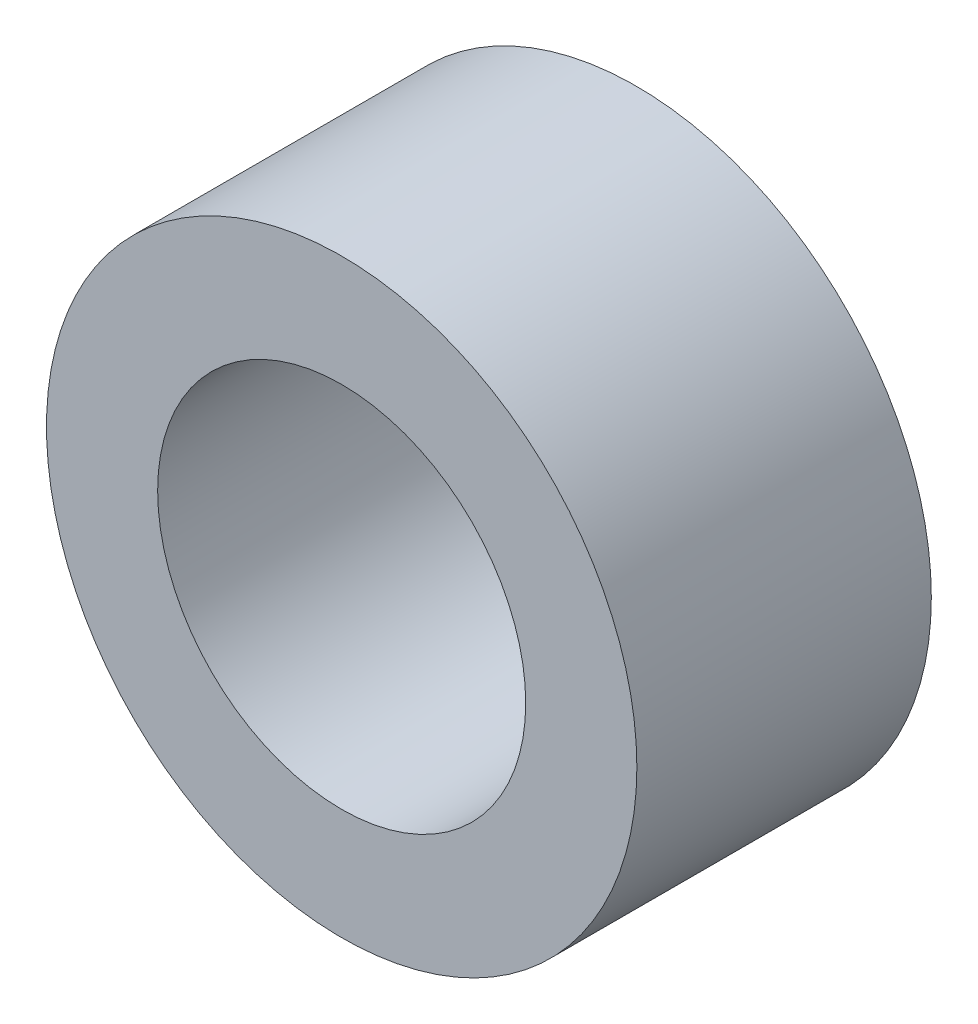
ISO-10303-21;
HEADER;
FILE_DESCRIPTION(('STEP AP214'),'2;1');
FILE_NAME('part.step','',(''),(''),'','','');
FILE_SCHEMA(('AUTOMOTIVE_DESIGN { 1 0 10303 214 1 1 1 1 }'));
ENDSEC;
DATA;
#1=APPLICATION_CONTEXT('core data for automotive mechanical design processes');
#2=APPLICATION_PROTOCOL_DEFINITION('international standard','automotive_design',2000,#1);
#3=PRODUCT_CONTEXT('',#1,'mechanical');
#4=PRODUCT('Part','Part','',(#3));
#5=PRODUCT_RELATED_PRODUCT_CATEGORY('part','',(#4));
#6=PRODUCT_DEFINITION_FORMATION('','',#4);
#7=PRODUCT_DEFINITION_CONTEXT('part definition',#1,'design');
#8=PRODUCT_DEFINITION('design','',#6,#7);
#9=PRODUCT_DEFINITION_SHAPE('','',#8);
#10=(LENGTH_UNIT() NAMED_UNIT(*) SI_UNIT(.MILLI.,.METRE.));
#11=(NAMED_UNIT(*) PLANE_ANGLE_UNIT() SI_UNIT($,.RADIAN.));
#12=(NAMED_UNIT(*) SI_UNIT($,.STERADIAN.) SOLID_ANGLE_UNIT());
#13=UNCERTAINTY_MEASURE_WITH_UNIT(LENGTH_MEASURE(1.E-05),#10,'distance_accuracy_value','');
#14=(GEOMETRIC_REPRESENTATION_CONTEXT(3) GLOBAL_UNCERTAINTY_ASSIGNED_CONTEXT((#13)) GLOBAL_UNIT_ASSIGNED_CONTEXT((#10,
#11,#12)) REPRESENTATION_CONTEXT('',''));
#15=CARTESIAN_POINT('',(0.,0.,0.));
#16=DIRECTION('',(0.,0.,1.));
#17=DIRECTION('',(1.,0.,0.));
#18=AXIS2_PLACEMENT_3D('',#15,#16,#17);
#19=CARTESIAN_POINT('',(0.,0.,2.));
#20=DIRECTION('',(0.,0.,1.));
#21=DIRECTION('',(1.,0.,0.));
#22=AXIS2_PLACEMENT_3D('',#19,#20,#21);
#23=PLANE('',#22);
#24=CARTESIAN_POINT('',(0.,0.,2.));
#25=DIRECTION('',(0.,0.,1.));
#26=DIRECTION('',(1.,0.,0.));
#27=AXIS2_PLACEMENT_3D('',#24,#25,#26);
#28=CIRCLE('',#27,4.01);
#29=CARTESIAN_POINT('',(4.01,0.,2.));
#30=VERTEX_POINT('',#29);
#31=EDGE_CURVE('E10',#30,#30,#28,.T.);
#32=ORIENTED_EDGE('',*,*,#31,.T.);
#33=EDGE_LOOP('',(#32));
#34=FACE_BOUND('',#33,.T.);
#35=CARTESIAN_POINT('',(0.,0.,2.));
#36=DIRECTION('',(0.,0.,1.));
#37=DIRECTION('',(1.,0.,0.));
#38=AXIS2_PLACEMENT_3D('',#35,#36,#37);
#39=CIRCLE('',#38,2.5);
#40=CARTESIAN_POINT('',(2.5,0.,2.));
#41=VERTEX_POINT('',#40);
#42=EDGE_CURVE('E44',#41,#41,#39,.T.);
#43=ORIENTED_EDGE('',*,*,#42,.F.);
#44=EDGE_LOOP('',(#43));
#45=FACE_BOUND('',#44,.T.);
#46=ADVANCED_FACE('F33',(#34,#45),#23,.T.);
#47=CARTESIAN_POINT('',(0.,0.,-2.));
#48=DIRECTION('',(0.,0.,1.));
#49=DIRECTION('',(1.,0.,0.));
#50=AXIS2_PLACEMENT_3D('',#47,#48,#49);
#51=PLANE('',#50);
#52=CARTESIAN_POINT('',(0.,0.,-2.));
#53=DIRECTION('',(0.,0.,1.));
#54=DIRECTION('',(1.,0.,0.));
#55=AXIS2_PLACEMENT_3D('',#52,#53,#54);
#56=CIRCLE('',#55,4.01);
#57=CARTESIAN_POINT('',(4.01,0.,-2.));
#58=VERTEX_POINT('',#57);
#59=EDGE_CURVE('E37',#58,#58,#56,.T.);
#60=ORIENTED_EDGE('',*,*,#59,.F.);
#61=EDGE_LOOP('',(#60));
#62=FACE_BOUND('',#61,.T.);
#63=CARTESIAN_POINT('',(0.,0.,-2.));
#64=DIRECTION('',(0.,0.,1.));
#65=DIRECTION('',(1.,0.,0.));
#66=AXIS2_PLACEMENT_3D('',#63,#64,#65);
#67=CIRCLE('',#66,2.5);
#68=CARTESIAN_POINT('',(2.5,0.,-2.));
#69=VERTEX_POINT('',#68);
#70=EDGE_CURVE('E46',#69,#69,#67,.T.);
#71=ORIENTED_EDGE('',*,*,#70,.T.);
#72=EDGE_LOOP('',(#71));
#73=FACE_BOUND('',#72,.T.);
#74=ADVANCED_FACE('F56',(#62,#73),#51,.F.);
#75=CARTESIAN_POINT('',(0.,0.,2.));
#76=DIRECTION('',(0.,0.,-1.));
#77=DIRECTION('',(-1.,0.,0.));
#78=AXIS2_PLACEMENT_3D('',#75,#76,#77);
#79=CYLINDRICAL_SURFACE('',#78,4.01);
#80=ORIENTED_EDGE('',*,*,#31,.F.);
#81=EDGE_LOOP('',(#80));
#82=FACE_BOUND('',#81,.T.);
#83=ORIENTED_EDGE('',*,*,#59,.T.);
#84=EDGE_LOOP('',(#83));
#85=FACE_BOUND('',#84,.T.);
#86=ADVANCED_FACE('F35',(#82,#85),#79,.T.);
#87=CARTESIAN_POINT('',(0.,0.,2.));
#88=DIRECTION('',(0.,0.,-1.));
#89=DIRECTION('',(-1.,0.,0.));
#90=AXIS2_PLACEMENT_3D('',#87,#88,#89);
#91=CYLINDRICAL_SURFACE('',#90,2.5);
#92=ORIENTED_EDGE('',*,*,#42,.T.);
#93=EDGE_LOOP('',(#92));
#94=FACE_BOUND('',#93,.T.);
#95=ORIENTED_EDGE('',*,*,#70,.F.);
#96=EDGE_LOOP('',(#95));
#97=FACE_BOUND('',#96,.T.);
#98=ADVANCED_FACE('F52',(#94,#97),#91,.F.);
#99=CLOSED_SHELL('',(#46,#74,#86,#98));
#100=MANIFOLD_SOLID_BREP('B2',#99);
#101=ADVANCED_BREP_SHAPE_REPRESENTATION('',(#18,#100),#14);
#102=SHAPE_DEFINITION_REPRESENTATION(#9,#101);
ENDSEC;
END-ISO-10303-21;
